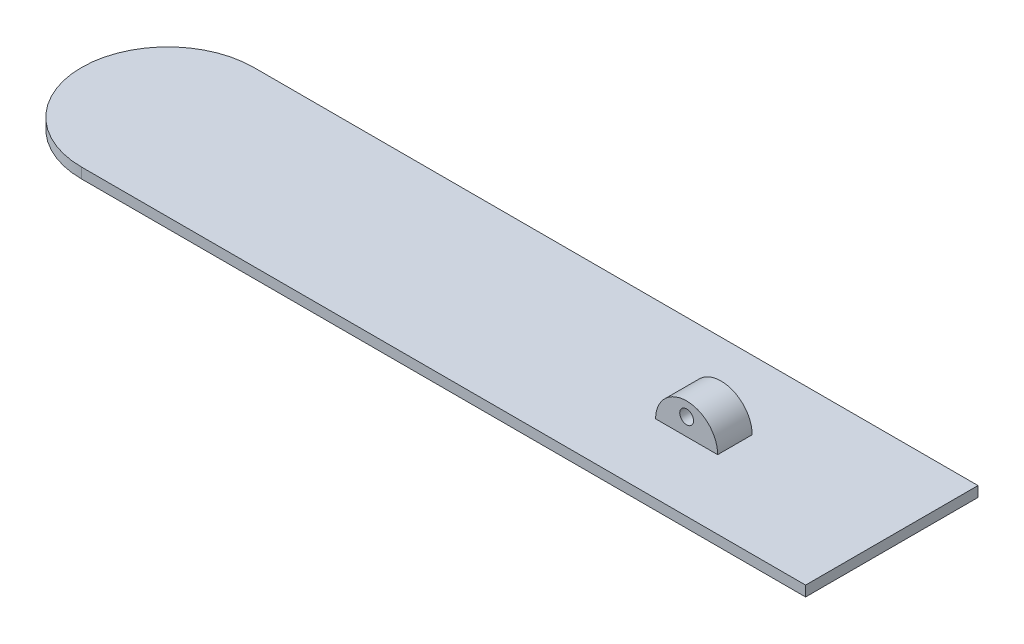
ISO-10303-21;
HEADER;
FILE_DESCRIPTION(('STEP AP214'),'2;1');
FILE_NAME('part.step','',(''),(''),'','','');
FILE_SCHEMA(('AUTOMOTIVE_DESIGN { 1 0 10303 214 1 1 1 1 }'));
ENDSEC;
DATA;
#1=APPLICATION_CONTEXT('core data for automotive mechanical design processes');
#2=APPLICATION_PROTOCOL_DEFINITION('international standard','automotive_design',2000,#1);
#3=PRODUCT_CONTEXT('',#1,'mechanical');
#4=PRODUCT('Part','Part','',(#3));
#5=PRODUCT_RELATED_PRODUCT_CATEGORY('part','',(#4));
#6=PRODUCT_DEFINITION_FORMATION('','',#4);
#7=PRODUCT_DEFINITION_CONTEXT('part definition',#1,'design');
#8=PRODUCT_DEFINITION('design','',#6,#7);
#9=PRODUCT_DEFINITION_SHAPE('','',#8);
#10=(LENGTH_UNIT() NAMED_UNIT(*) SI_UNIT(.MILLI.,.METRE.));
#11=(NAMED_UNIT(*) PLANE_ANGLE_UNIT() SI_UNIT($,.RADIAN.));
#12=(NAMED_UNIT(*) SI_UNIT($,.STERADIAN.) SOLID_ANGLE_UNIT());
#13=UNCERTAINTY_MEASURE_WITH_UNIT(LENGTH_MEASURE(1.E-05),#10,'distance_accuracy_value','');
#14=(GEOMETRIC_REPRESENTATION_CONTEXT(3) GLOBAL_UNCERTAINTY_ASSIGNED_CONTEXT((#13)) GLOBAL_UNIT_ASSIGNED_CONTEXT((#10,
#11,#12)) REPRESENTATION_CONTEXT('',''));
#15=CARTESIAN_POINT('',(0.,0.,0.));
#16=DIRECTION('',(0.,0.,1.));
#17=DIRECTION('',(1.,0.,0.));
#18=AXIS2_PLACEMENT_3D('',#15,#16,#17);
#19=CARTESIAN_POINT('',(0.,3.,-25.));
#20=DIRECTION('',(0.,1.,0.));
#21=DIRECTION('',(0.,0.,1.));
#22=AXIS2_PLACEMENT_3D('',#19,#20,#21);
#23=PLANE('',#22);
#24=CARTESIAN_POINT('',(0.,3.,-25.));
#25=DIRECTION('',(0.,1.,0.));
#26=DIRECTION('',(0.,0.,1.));
#27=AXIS2_PLACEMENT_3D('',#24,#25,#26);
#28=CIRCLE('',#27,25.);
#29=CARTESIAN_POINT('',(0.,3.,-50.));
#30=VERTEX_POINT('',#29);
#31=CARTESIAN_POINT('',(0.,3.,0.));
#32=VERTEX_POINT('',#31);
#33=EDGE_CURVE('E120',#30,#32,#28,.T.);
#34=ORIENTED_EDGE('',*,*,#33,.T.);
#35=DIRECTION('',(1.,0.,0.));
#36=VECTOR('',#35,1.);
#37=CARTESIAN_POINT('',(0.,3.,0.));
#38=LINE('',#37,#36);
#39=CARTESIAN_POINT('',(210.,3.,0.));
#40=VERTEX_POINT('',#39);
#41=EDGE_CURVE('E86',#32,#40,#38,.T.);
#42=ORIENTED_EDGE('',*,*,#41,.T.);
#43=DIRECTION('',(0.,0.,-1.));
#44=VECTOR('',#43,1.);
#45=CARTESIAN_POINT('',(210.,3.,0.));
#46=LINE('',#45,#44);
#47=CARTESIAN_POINT('',(210.,3.,-50.));
#48=VERTEX_POINT('',#47);
#49=EDGE_CURVE('E124',#40,#48,#46,.T.);
#50=ORIENTED_EDGE('',*,*,#49,.T.);
#51=DIRECTION('',(1.,0.,0.));
#52=VECTOR('',#51,1.);
#53=CARTESIAN_POINT('',(0.,3.,-50.));
#54=LINE('',#53,#52);
#55=EDGE_CURVE('E126',#30,#48,#54,.T.);
#56=ORIENTED_EDGE('',*,*,#55,.F.);
#57=EDGE_LOOP('',(#34,#42,#50,#56));
#58=FACE_BOUND('',#57,.T.);
#59=DIRECTION('',(1.,0.,0.));
#60=VECTOR('',#59,1.);
#61=CARTESIAN_POINT('',(146.5,3.,-30.));
#62=LINE('',#61,#60);
#63=CARTESIAN_POINT('',(146.5,3.,-30.));
#64=VERTEX_POINT('',#63);
#65=CARTESIAN_POINT('',(164.5,3.,-30.));
#66=VERTEX_POINT('',#65);
#67=EDGE_CURVE('E103',#64,#66,#62,.T.);
#68=ORIENTED_EDGE('',*,*,#67,.T.);
#69=DIRECTION('',(0.,0.,-1.));
#70=VECTOR('',#69,1.);
#71=CARTESIAN_POINT('',(164.5,3.,-20.));
#72=LINE('',#71,#70);
#73=CARTESIAN_POINT('',(164.5,3.,-20.));
#74=VERTEX_POINT('',#73);
#75=EDGE_CURVE('E111',#74,#66,#72,.T.);
#76=ORIENTED_EDGE('',*,*,#75,.F.);
#77=DIRECTION('',(1.,0.,0.));
#78=VECTOR('',#77,1.);
#79=CARTESIAN_POINT('',(146.5,3.,-20.));
#80=LINE('',#79,#78);
#81=CARTESIAN_POINT('',(146.5,3.,-20.));
#82=VERTEX_POINT('',#81);
#83=EDGE_CURVE('E101',#82,#74,#80,.T.);
#84=ORIENTED_EDGE('',*,*,#83,.F.);
#85=DIRECTION('',(0.,0.,-1.));
#86=VECTOR('',#85,1.);
#87=CARTESIAN_POINT('',(146.5,3.,-20.));
#88=LINE('',#87,#86);
#89=EDGE_CURVE('E106',#82,#64,#88,.T.);
#90=ORIENTED_EDGE('',*,*,#89,.T.);
#91=EDGE_LOOP('',(#68,#76,#84,#90));
#92=FACE_BOUND('',#91,.T.);
#93=ADVANCED_FACE('F36',(#58,#92),#23,.T.);
#94=CARTESIAN_POINT('',(0.,3.,-25.));
#95=DIRECTION('',(0.,-1.,0.));
#96=DIRECTION('',(0.,0.,-1.));
#97=AXIS2_PLACEMENT_3D('',#94,#95,#96);
#98=CYLINDRICAL_SURFACE('',#97,25.);
#99=CARTESIAN_POINT('',(0.,0.,-25.));
#100=DIRECTION('',(0.,1.,0.));
#101=DIRECTION('',(0.,0.,1.));
#102=AXIS2_PLACEMENT_3D('',#99,#100,#101);
#103=CIRCLE('',#102,25.);
#104=CARTESIAN_POINT('',(0.,0.,-50.));
#105=VERTEX_POINT('',#104);
#106=CARTESIAN_POINT('',(0.,0.,0.));
#107=VERTEX_POINT('',#106);
#108=EDGE_CURVE('E110',#105,#107,#103,.T.);
#109=ORIENTED_EDGE('',*,*,#108,.T.);
#110=DIRECTION('',(0.,-1.,0.));
#111=VECTOR('',#110,1.);
#112=CARTESIAN_POINT('',(0.,3.,0.));
#113=LINE('',#112,#111);
#114=EDGE_CURVE('E11',#32,#107,#113,.T.);
#115=ORIENTED_EDGE('',*,*,#114,.F.);
#116=ORIENTED_EDGE('',*,*,#33,.F.);
#117=DIRECTION('',(0.,-1.,0.));
#118=VECTOR('',#117,1.);
#119=CARTESIAN_POINT('',(0.,3.,-50.));
#120=LINE('',#119,#118);
#121=EDGE_CURVE('E60',#30,#105,#120,.T.);
#122=ORIENTED_EDGE('',*,*,#121,.T.);
#123=EDGE_LOOP('',(#109,#115,#116,#122));
#124=FACE_BOUND('',#123,.T.);
#125=ADVANCED_FACE('F38',(#124),#98,.T.);
#126=CARTESIAN_POINT('',(0.,3.,0.));
#127=DIRECTION('',(0.,0.,-1.));
#128=DIRECTION('',(-1.,0.,0.));
#129=AXIS2_PLACEMENT_3D('',#126,#127,#128);
#130=PLANE('',#129);
#131=DIRECTION('',(1.,0.,0.));
#132=VECTOR('',#131,1.);
#133=CARTESIAN_POINT('',(0.,0.,0.));
#134=LINE('',#133,#132);
#135=CARTESIAN_POINT('',(210.,0.,0.));
#136=VERTEX_POINT('',#135);
#137=EDGE_CURVE('E129',#107,#136,#134,.T.);
#138=ORIENTED_EDGE('',*,*,#137,.T.);
#139=DIRECTION('',(0.,-1.,0.));
#140=VECTOR('',#139,1.);
#141=CARTESIAN_POINT('',(210.,3.,0.));
#142=LINE('',#141,#140);
#143=EDGE_CURVE('E44',#40,#136,#142,.T.);
#144=ORIENTED_EDGE('',*,*,#143,.F.);
#145=ORIENTED_EDGE('',*,*,#41,.F.);
#146=ORIENTED_EDGE('',*,*,#114,.T.);
#147=EDGE_LOOP('',(#138,#144,#145,#146));
#148=FACE_BOUND('',#147,.T.);
#149=ADVANCED_FACE('F150',(#148),#130,.F.);
#150=CARTESIAN_POINT('',(210.,3.,0.));
#151=DIRECTION('',(-1.,0.,0.));
#152=DIRECTION('',(0.,0.,1.));
#153=AXIS2_PLACEMENT_3D('',#150,#151,#152);
#154=PLANE('',#153);
#155=DIRECTION('',(0.,0.,-1.));
#156=VECTOR('',#155,1.);
#157=CARTESIAN_POINT('',(210.,0.,0.));
#158=LINE('',#157,#156);
#159=CARTESIAN_POINT('',(210.,0.,-50.));
#160=VERTEX_POINT('',#159);
#161=EDGE_CURVE('E131',#136,#160,#158,.T.);
#162=ORIENTED_EDGE('',*,*,#161,.T.);
#163=DIRECTION('',(0.,-1.,0.));
#164=VECTOR('',#163,1.);
#165=CARTESIAN_POINT('',(210.,3.,-50.));
#166=LINE('',#165,#164);
#167=EDGE_CURVE('E137',#48,#160,#166,.T.);
#168=ORIENTED_EDGE('',*,*,#167,.F.);
#169=ORIENTED_EDGE('',*,*,#49,.F.);
#170=ORIENTED_EDGE('',*,*,#143,.T.);
#171=EDGE_LOOP('',(#162,#168,#169,#170));
#172=FACE_BOUND('',#171,.T.);
#173=ADVANCED_FACE('F142',(#172),#154,.F.);
#174=CARTESIAN_POINT('',(0.,3.,-50.));
#175=DIRECTION('',(0.,0.,-1.));
#176=DIRECTION('',(-1.,0.,0.));
#177=AXIS2_PLACEMENT_3D('',#174,#175,#176);
#178=PLANE('',#177);
#179=DIRECTION('',(1.,0.,0.));
#180=VECTOR('',#179,1.);
#181=CARTESIAN_POINT('',(0.,0.,-50.));
#182=LINE('',#181,#180);
#183=EDGE_CURVE('E122',#105,#160,#182,.T.);
#184=ORIENTED_EDGE('',*,*,#183,.F.);
#185=ORIENTED_EDGE('',*,*,#121,.F.);
#186=ORIENTED_EDGE('',*,*,#55,.T.);
#187=ORIENTED_EDGE('',*,*,#167,.T.);
#188=EDGE_LOOP('',(#184,#185,#186,#187));
#189=FACE_BOUND('',#188,.T.);
#190=ADVANCED_FACE('F146',(#189),#178,.T.);
#191=CARTESIAN_POINT('',(0.,0.,-25.));
#192=DIRECTION('',(0.,1.,0.));
#193=DIRECTION('',(0.,0.,1.));
#194=AXIS2_PLACEMENT_3D('',#191,#192,#193);
#195=PLANE('',#194);
#196=ORIENTED_EDGE('',*,*,#108,.F.);
#197=ORIENTED_EDGE('',*,*,#183,.T.);
#198=ORIENTED_EDGE('',*,*,#161,.F.);
#199=ORIENTED_EDGE('',*,*,#137,.F.);
#200=EDGE_LOOP('',(#196,#197,#198,#199));
#201=FACE_BOUND('',#200,.T.);
#202=ADVANCED_FACE('F145',(#201),#195,.F.);
#203=CARTESIAN_POINT('',(155.5,3.,-20.));
#204=DIRECTION('',(0.,0.,1.));
#205=DIRECTION('',(1.,0.,0.));
#206=AXIS2_PLACEMENT_3D('',#203,#204,#205);
#207=PLANE('',#206);
#208=CARTESIAN_POINT('',(155.5,3.,-20.));
#209=DIRECTION('',(0.,0.,1.));
#210=DIRECTION('',(1.,0.,0.));
#211=AXIS2_PLACEMENT_3D('',#208,#209,#210);
#212=CIRCLE('',#211,9.00000000000001);
#213=EDGE_CURVE('E97',#74,#82,#212,.T.);
#214=ORIENTED_EDGE('',*,*,#213,.T.);
#215=ORIENTED_EDGE('',*,*,#83,.T.);
#216=EDGE_LOOP('',(#214,#215));
#217=FACE_BOUND('',#216,.T.);
#218=CARTESIAN_POINT('',(155.5,8.,-20.));
#219=DIRECTION('',(0.,0.,1.));
#220=DIRECTION('',(1.,0.,0.));
#221=AXIS2_PLACEMENT_3D('',#218,#219,#220);
#222=CIRCLE('',#221,2.);
#223=CARTESIAN_POINT('',(157.5,8.,-20.));
#224=VERTEX_POINT('',#223);
#225=EDGE_CURVE('E118',#224,#224,#222,.T.);
#226=ORIENTED_EDGE('',*,*,#225,.F.);
#227=EDGE_LOOP('',(#226));
#228=FACE_BOUND('',#227,.T.);
#229=ADVANCED_FACE('F98',(#217,#228),#207,.T.);
#230=CARTESIAN_POINT('',(155.5,3.,-30.));
#231=DIRECTION('',(0.,0.,1.));
#232=DIRECTION('',(1.,0.,0.));
#233=AXIS2_PLACEMENT_3D('',#230,#231,#232);
#234=PLANE('',#233);
#235=CARTESIAN_POINT('',(155.5,3.,-30.));
#236=DIRECTION('',(0.,0.,1.));
#237=DIRECTION('',(1.,0.,0.));
#238=AXIS2_PLACEMENT_3D('',#235,#236,#237);
#239=CIRCLE('',#238,9.00000000000001);
#240=EDGE_CURVE('E51',#66,#64,#239,.T.);
#241=ORIENTED_EDGE('',*,*,#240,.F.);
#242=ORIENTED_EDGE('',*,*,#67,.F.);
#243=EDGE_LOOP('',(#241,#242));
#244=FACE_BOUND('',#243,.T.);
#245=CARTESIAN_POINT('',(155.5,8.,-30.));
#246=DIRECTION('',(0.,0.,1.));
#247=DIRECTION('',(1.,0.,0.));
#248=AXIS2_PLACEMENT_3D('',#245,#246,#247);
#249=CIRCLE('',#248,2.);
#250=CARTESIAN_POINT('',(157.5,8.,-30.));
#251=VERTEX_POINT('',#250);
#252=EDGE_CURVE('E238',#251,#251,#249,.T.);
#253=ORIENTED_EDGE('',*,*,#252,.T.);
#254=EDGE_LOOP('',(#253));
#255=FACE_BOUND('',#254,.T.);
#256=ADVANCED_FACE('F181',(#244,#255),#234,.F.);
#257=CARTESIAN_POINT('',(155.5,3.,-20.));
#258=DIRECTION('',(0.,0.,-1.));
#259=DIRECTION('',(-1.,0.,0.));
#260=AXIS2_PLACEMENT_3D('',#257,#258,#259);
#261=CYLINDRICAL_SURFACE('',#260,9.00000000000001);
#262=ORIENTED_EDGE('',*,*,#240,.T.);
#263=ORIENTED_EDGE('',*,*,#89,.F.);
#264=ORIENTED_EDGE('',*,*,#213,.F.);
#265=ORIENTED_EDGE('',*,*,#75,.T.);
#266=EDGE_LOOP('',(#262,#263,#264,#265));
#267=FACE_BOUND('',#266,.T.);
#268=ADVANCED_FACE('F107',(#267),#261,.T.);
#269=CARTESIAN_POINT('',(155.5,8.,-20.));
#270=DIRECTION('',(0.,0.,-1.));
#271=DIRECTION('',(-1.,0.,0.));
#272=AXIS2_PLACEMENT_3D('',#269,#270,#271);
#273=CYLINDRICAL_SURFACE('',#272,2.);
#274=ORIENTED_EDGE('',*,*,#225,.T.);
#275=EDGE_LOOP('',(#274));
#276=FACE_BOUND('',#275,.T.);
#277=ORIENTED_EDGE('',*,*,#252,.F.);
#278=EDGE_LOOP('',(#277));
#279=FACE_BOUND('',#278,.T.);
#280=ADVANCED_FACE('F194',(#276,#279),#273,.F.);
#281=CLOSED_SHELL('',(#93,#125,#149,#173,#190,#202,#229,#256,#268,#280));
#282=MANIFOLD_SOLID_BREP('B2',#281);
#283=ADVANCED_BREP_SHAPE_REPRESENTATION('',(#18,#282),#14);
#284=SHAPE_DEFINITION_REPRESENTATION(#9,#283);
ENDSEC;
END-ISO-10303-21;
